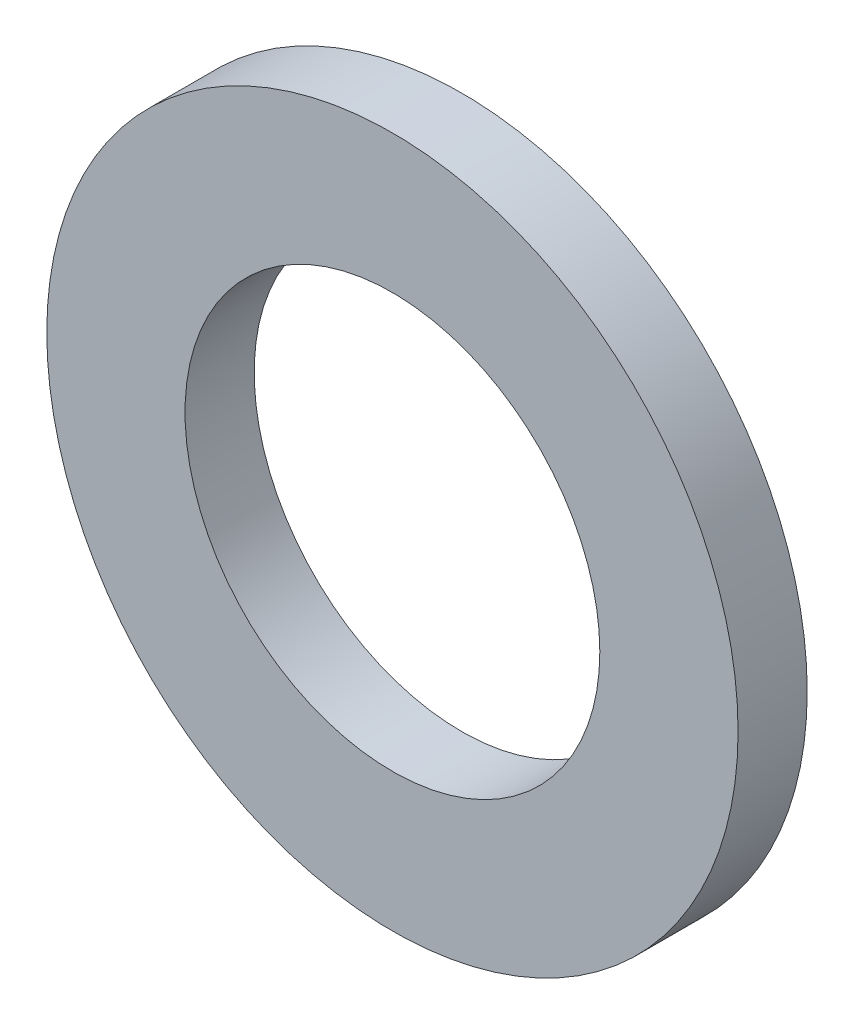
ISO-10303-21;
HEADER;
FILE_DESCRIPTION(('STEP AP214'),'2;1');
FILE_NAME('part.step','',(''),(''),'','','');
FILE_SCHEMA(('AUTOMOTIVE_DESIGN { 1 0 10303 214 1 1 1 1 }'));
ENDSEC;
DATA;
#1=APPLICATION_CONTEXT('core data for automotive mechanical design processes');
#2=APPLICATION_PROTOCOL_DEFINITION('international standard','automotive_design',2000,#1);
#3=PRODUCT_CONTEXT('',#1,'mechanical');
#4=PRODUCT('Part','Part','',(#3));
#5=PRODUCT_RELATED_PRODUCT_CATEGORY('part','',(#4));
#6=PRODUCT_DEFINITION_FORMATION('','',#4);
#7=PRODUCT_DEFINITION_CONTEXT('part definition',#1,'design');
#8=PRODUCT_DEFINITION('design','',#6,#7);
#9=PRODUCT_DEFINITION_SHAPE('','',#8);
#10=(LENGTH_UNIT() NAMED_UNIT(*) SI_UNIT(.MILLI.,.METRE.));
#11=(NAMED_UNIT(*) PLANE_ANGLE_UNIT() SI_UNIT($,.RADIAN.));
#12=(NAMED_UNIT(*) SI_UNIT($,.STERADIAN.) SOLID_ANGLE_UNIT());
#13=UNCERTAINTY_MEASURE_WITH_UNIT(LENGTH_MEASURE(1.E-05),#10,'distance_accuracy_value','');
#14=(GEOMETRIC_REPRESENTATION_CONTEXT(3) GLOBAL_UNCERTAINTY_ASSIGNED_CONTEXT((#13)) GLOBAL_UNIT_ASSIGNED_CONTEXT((#10,
#11,#12)) REPRESENTATION_CONTEXT('',''));
#15=CARTESIAN_POINT('',(0.,0.,0.));
#16=DIRECTION('',(0.,0.,1.));
#17=DIRECTION('',(1.,0.,0.));
#18=AXIS2_PLACEMENT_3D('',#15,#16,#17);
#19=CARTESIAN_POINT('',(0.,0.,0.5));
#20=DIRECTION('',(0.,0.,1.));
#21=DIRECTION('',(1.,0.,0.));
#22=AXIS2_PLACEMENT_3D('',#19,#20,#21);
#23=PLANE('',#22);
#24=CARTESIAN_POINT('',(0.,0.,0.5));
#25=DIRECTION('',(0.,0.,1.));
#26=DIRECTION('',(1.,0.,0.));
#27=AXIS2_PLACEMENT_3D('',#24,#25,#26);
#28=CIRCLE('',#27,2.5);
#29=CARTESIAN_POINT('',(2.5,0.,0.5));
#30=VERTEX_POINT('',#29);
#31=EDGE_CURVE('E10',#30,#30,#28,.T.);
#32=ORIENTED_EDGE('',*,*,#31,.T.);
#33=EDGE_LOOP('',(#32));
#34=FACE_BOUND('',#33,.T.);
#35=CARTESIAN_POINT('',(0.,0.,0.5));
#36=DIRECTION('',(0.,0.,1.));
#37=DIRECTION('',(1.,0.,0.));
#38=AXIS2_PLACEMENT_3D('',#35,#36,#37);
#39=CIRCLE('',#38,1.5);
#40=CARTESIAN_POINT('',(1.5,0.,0.5));
#41=VERTEX_POINT('',#40);
#42=EDGE_CURVE('E54',#41,#41,#39,.T.);
#43=ORIENTED_EDGE('',*,*,#42,.F.);
#44=EDGE_LOOP('',(#43));
#45=FACE_BOUND('',#44,.T.);
#46=ADVANCED_FACE('F41',(#34,#45),#23,.T.);
#47=CARTESIAN_POINT('',(0.,0.,0.));
#48=DIRECTION('',(0.,0.,1.));
#49=DIRECTION('',(1.,0.,0.));
#50=AXIS2_PLACEMENT_3D('',#47,#48,#49);
#51=PLANE('',#50);
#52=CARTESIAN_POINT('',(0.,0.,0.));
#53=DIRECTION('',(0.,0.,1.));
#54=DIRECTION('',(1.,0.,0.));
#55=AXIS2_PLACEMENT_3D('',#52,#53,#54);
#56=CIRCLE('',#55,2.5);
#57=CARTESIAN_POINT('',(2.5,0.,0.));
#58=VERTEX_POINT('',#57);
#59=EDGE_CURVE('E45',#58,#58,#56,.T.);
#60=ORIENTED_EDGE('',*,*,#59,.F.);
#61=EDGE_LOOP('',(#60));
#62=FACE_BOUND('',#61,.T.);
#63=CARTESIAN_POINT('',(0.,0.,0.));
#64=DIRECTION('',(0.,0.,1.));
#65=DIRECTION('',(1.,0.,0.));
#66=AXIS2_PLACEMENT_3D('',#63,#64,#65);
#67=CIRCLE('',#66,1.5);
#68=CARTESIAN_POINT('',(1.5,0.,0.));
#69=VERTEX_POINT('',#68);
#70=EDGE_CURVE('E56',#69,#69,#67,.T.);
#71=ORIENTED_EDGE('',*,*,#70,.T.);
#72=EDGE_LOOP('',(#71));
#73=FACE_BOUND('',#72,.T.);
#74=ADVANCED_FACE('F68',(#62,#73),#51,.F.);
#75=CARTESIAN_POINT('',(0.,0.,0.5));
#76=DIRECTION('',(0.,0.,-1.));
#77=DIRECTION('',(-1.,0.,0.));
#78=AXIS2_PLACEMENT_3D('',#75,#76,#77);
#79=CYLINDRICAL_SURFACE('',#78,2.5);
#80=ORIENTED_EDGE('',*,*,#31,.F.);
#81=EDGE_LOOP('',(#80));
#82=FACE_BOUND('',#81,.T.);
#83=ORIENTED_EDGE('',*,*,#59,.T.);
#84=EDGE_LOOP('',(#83));
#85=FACE_BOUND('',#84,.T.);
#86=ADVANCED_FACE('F43',(#82,#85),#79,.T.);
#87=CARTESIAN_POINT('',(0.,0.,0.5));
#88=DIRECTION('',(0.,0.,-1.));
#89=DIRECTION('',(-1.,0.,0.));
#90=AXIS2_PLACEMENT_3D('',#87,#88,#89);
#91=CYLINDRICAL_SURFACE('',#90,1.5);
#92=ORIENTED_EDGE('',*,*,#42,.T.);
#93=EDGE_LOOP('',(#92));
#94=FACE_BOUND('',#93,.T.);
#95=ORIENTED_EDGE('',*,*,#70,.F.);
#96=EDGE_LOOP('',(#95));
#97=FACE_BOUND('',#96,.T.);
#98=ADVANCED_FACE('F64',(#94,#97),#91,.F.);
#99=CLOSED_SHELL('',(#46,#74,#86,#98));
#100=MANIFOLD_SOLID_BREP('B2',#99);
#101=ADVANCED_BREP_SHAPE_REPRESENTATION('',(#18,#100),#14);
#102=SHAPE_DEFINITION_REPRESENTATION(#9,#101);
ENDSEC;
END-ISO-10303-21;
